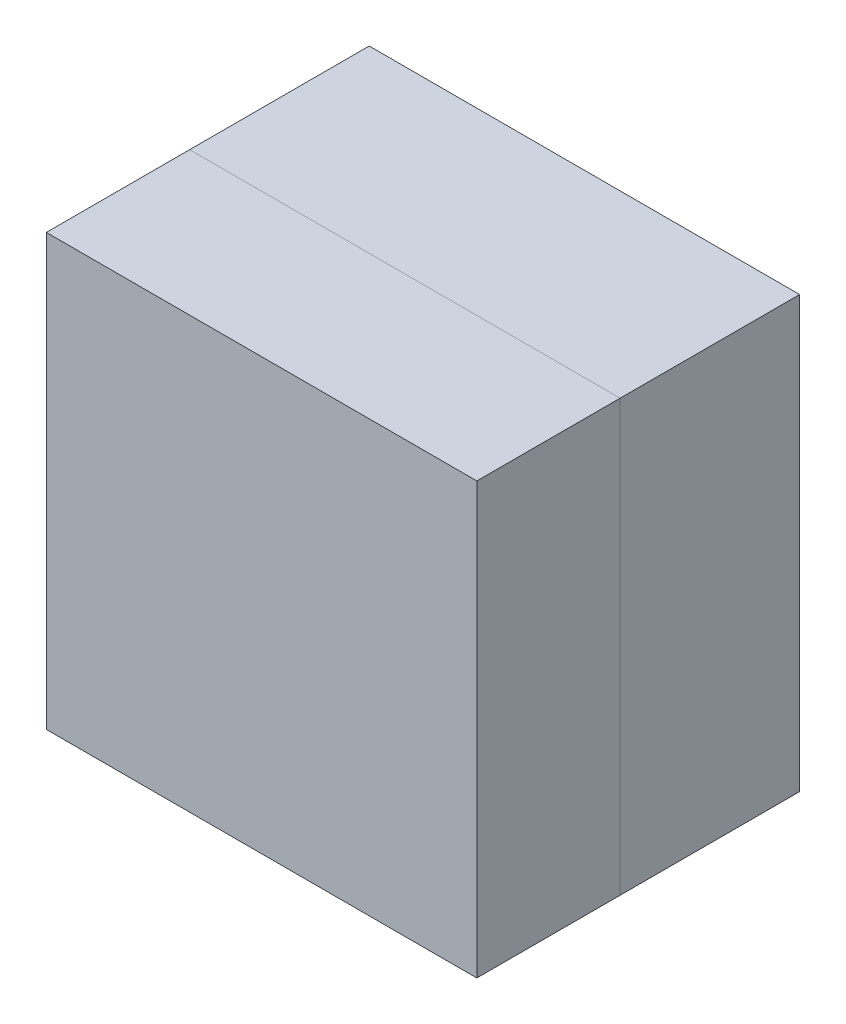
ISO-10303-21;
HEADER;
FILE_DESCRIPTION(('STEP AP214'),'2;1');
FILE_NAME('part.step','',(''),(''),'','','');
FILE_SCHEMA(('AUTOMOTIVE_DESIGN { 1 0 10303 214 1 1 1 1 }'));
ENDSEC;
DATA;
#1=APPLICATION_CONTEXT('core data for automotive mechanical design processes');
#2=APPLICATION_PROTOCOL_DEFINITION('international standard','automotive_design',2000,#1);
#3=PRODUCT_CONTEXT('',#1,'mechanical');
#4=PRODUCT('Part','Part','',(#3));
#5=PRODUCT_RELATED_PRODUCT_CATEGORY('part','',(#4));
#6=PRODUCT_DEFINITION_FORMATION('','',#4);
#7=PRODUCT_DEFINITION_CONTEXT('part definition',#1,'design');
#8=PRODUCT_DEFINITION('design','',#6,#7);
#9=PRODUCT_DEFINITION_SHAPE('','',#8);
#10=(LENGTH_UNIT() NAMED_UNIT(*) SI_UNIT(.MILLI.,.METRE.));
#11=(NAMED_UNIT(*) PLANE_ANGLE_UNIT() SI_UNIT($,.RADIAN.));
#12=(NAMED_UNIT(*) SI_UNIT($,.STERADIAN.) SOLID_ANGLE_UNIT());
#13=UNCERTAINTY_MEASURE_WITH_UNIT(LENGTH_MEASURE(1.E-05),#10,'distance_accuracy_value','');
#14=(GEOMETRIC_REPRESENTATION_CONTEXT(3) GLOBAL_UNCERTAINTY_ASSIGNED_CONTEXT((#13)) GLOBAL_UNIT_ASSIGNED_CONTEXT((#10,
#11,#12)) REPRESENTATION_CONTEXT('',''));
#15=CARTESIAN_POINT('',(0.,0.,0.));
#16=DIRECTION('',(0.,0.,1.));
#17=DIRECTION('',(1.,0.,0.));
#18=AXIS2_PLACEMENT_3D('',#15,#16,#17);
#19=CARTESIAN_POINT('',(0.,-4.61267334725164E-13,127.132943369893));
#20=DIRECTION('',(0.,0.,-1.));
#21=DIRECTION('',(0.,1.,0.));
#22=AXIS2_PLACEMENT_3D('',#19,#20,#21);
#23=PLANE('',#22);
#24=DIRECTION('',(-1.,0.,0.));
#25=VECTOR('',#24,1.);
#26=CARTESIAN_POINT('',(152.4,-152.4,127.132943369892));
#27=LINE('',#26,#25);
#28=CARTESIAN_POINT('',(152.4,-152.4,127.132943369893));
#29=VERTEX_POINT('',#28);
#30=CARTESIAN_POINT('',(-152.4,-152.4,127.132943369892));
#31=VERTEX_POINT('',#30);
#32=EDGE_CURVE('E102',#29,#31,#27,.T.);
#33=ORIENTED_EDGE('',*,*,#32,.T.);
#34=DIRECTION('',(0.,1.,0.));
#35=VECTOR('',#34,1.);
#36=CARTESIAN_POINT('',(-152.4,152.4,127.132943369893));
#37=LINE('',#36,#35);
#38=CARTESIAN_POINT('',(-152.4,152.4,127.132943369893));
#39=VERTEX_POINT('',#38);
#40=EDGE_CURVE('E88',#31,#39,#37,.T.);
#41=ORIENTED_EDGE('',*,*,#40,.T.);
#42=DIRECTION('',(1.,0.,0.));
#43=VECTOR('',#42,1.);
#44=CARTESIAN_POINT('',(152.4,152.4,127.132943369893));
#45=LINE('',#44,#43);
#46=CARTESIAN_POINT('',(152.4,152.4,127.132943369893));
#47=VERTEX_POINT('',#46);
#48=EDGE_CURVE('E100',#39,#47,#45,.T.);
#49=ORIENTED_EDGE('',*,*,#48,.T.);
#50=DIRECTION('',(0.,-1.,0.));
#51=VECTOR('',#50,1.);
#52=CARTESIAN_POINT('',(152.4,152.4,127.132943369893));
#53=LINE('',#52,#51);
#54=EDGE_CURVE('E107',#47,#29,#53,.T.);
#55=ORIENTED_EDGE('',*,*,#54,.T.);
#56=EDGE_LOOP('',(#33,#41,#49,#55));
#57=FACE_BOUND('',#56,.T.);
#58=CARTESIAN_POINT('',(0.90869526163995,-0.0776127525782167,127.132943369893));
#59=DIRECTION('',(0.,0.,1.));
#60=DIRECTION('',(0.,-1.,0.));
#61=AXIS2_PLACEMENT_3D('',#58,#59,#60);
#62=CIRCLE('',#61,91.1860000000005);
#63=CARTESIAN_POINT('',(0.90869526163995,-91.2636127525787,127.132943369892));
#64=VERTEX_POINT('',#63);
#65=EDGE_CURVE('E12',#64,#64,#62,.T.);
#66=ORIENTED_EDGE('',*,*,#65,.T.);
#67=EDGE_LOOP('',(#66));
#68=FACE_BOUND('',#67,.T.);
#69=ADVANCED_FACE('F44',(#57,#68),#23,.T.);
#70=CARTESIAN_POINT('',(0.90869526163995,-138.632902158747,224.450968055005));
#71=DIRECTION('',(0.,0.,-1.));
#72=DIRECTION('',(0.,1.,0.));
#73=AXIS2_PLACEMENT_3D('',#70,#71,#72);
#74=PLANE('',#73);
#75=CARTESIAN_POINT('',(0.90869526163995,-0.0776127525785565,224.450968055006));
#76=DIRECTION('',(0.,0.,1.));
#77=DIRECTION('',(0.,-1.,0.));
#78=AXIS2_PLACEMENT_3D('',#75,#76,#77);
#79=CIRCLE('',#78,138.555289406168);
#80=CARTESIAN_POINT('',(0.90869526163995,-138.632902158747,224.450968055005));
#81=VERTEX_POINT('',#80);
#82=EDGE_CURVE('E143',#81,#81,#79,.T.);
#83=ORIENTED_EDGE('',*,*,#82,.F.);
#84=EDGE_LOOP('',(#83));
#85=FACE_BOUND('',#84,.T.);
#86=ADVANCED_FACE('F157',(#85),#74,.T.);
#87=CARTESIAN_POINT('',(0.90869526163995,-0.0776127525783632,169.085651996013));
#88=DIRECTION('',(0.,0.,1.));
#89=DIRECTION('',(0.,-1.,0.));
#90=AXIS2_PLACEMENT_3D('',#87,#88,#89);
#91=CYLINDRICAL_SURFACE('',#90,138.555289406168);
#92=ORIENTED_EDGE('',*,*,#82,.T.);
#93=EDGE_LOOP('',(#92));
#94=FACE_BOUND('',#93,.T.);
#95=CARTESIAN_POINT('',(0.90869526163995,-0.0776127525785146,212.450968055006));
#96=DIRECTION('',(0.,0.,1.));
#97=DIRECTION('',(0.,-1.,0.));
#98=AXIS2_PLACEMENT_3D('',#95,#96,#97);
#99=CIRCLE('',#98,138.555289406168);
#100=CARTESIAN_POINT('',(0.90869526163995,-138.632902158747,212.450968055005));
#101=VERTEX_POINT('',#100);
#102=EDGE_CURVE('E140',#101,#101,#99,.T.);
#103=ORIENTED_EDGE('',*,*,#102,.F.);
#104=EDGE_LOOP('',(#103));
#105=FACE_BOUND('',#104,.T.);
#106=ADVANCED_FACE('F160',(#94,#105),#91,.F.);
#107=CARTESIAN_POINT('',(0.90869526163995,-0.0776127525785141,212.327662527832));
#108=DIRECTION('',(0.,0.,1.));
#109=DIRECTION('',(0.,-1.,0.));
#110=AXIS2_PLACEMENT_3D('',#107,#108,#109);
#111=TOROIDAL_SURFACE('',#110,134.112,4.44499999999991);
#112=CARTESIAN_POINT('',(0.90869526163995,-0.0776127525784987,207.904943369893));
#113=DIRECTION('',(0.,0.,1.));
#114=DIRECTION('',(0.,-1.,0.));
#115=AXIS2_PLACEMENT_3D('',#112,#113,#114);
#116=CIRCLE('',#115,133.667500000001);
#117=CARTESIAN_POINT('',(0.90869526163995,-133.745112752579,207.904943369892));
#118=VERTEX_POINT('',#117);
#119=EDGE_CURVE('E137',#118,#118,#116,.T.);
#120=ORIENTED_EDGE('',*,*,#119,.F.);
#121=EDGE_LOOP('',(#120));
#122=FACE_BOUND('',#121,.T.);
#123=ORIENTED_EDGE('',*,*,#102,.T.);
#124=EDGE_LOOP('',(#123));
#125=FACE_BOUND('',#124,.T.);
#126=ADVANCED_FACE('F165',(#122,#125),#111,.F.);
#127=CARTESIAN_POINT('',(0.90869526163995,-0.0776127525784766,201.586773144266));
#128=DIRECTION('',(0.,0.,1.));
#129=DIRECTION('',(0.,-1.,0.));
#130=AXIS2_PLACEMENT_3D('',#127,#128,#129);
#131=TOROIDAL_SURFACE('',#130,133.0325,6.34999999999996);
#132=ORIENTED_EDGE('',*,*,#119,.T.);
#133=EDGE_LOOP('',(#132));
#134=FACE_BOUND('',#133,.T.);
#135=CARTESIAN_POINT('',(0.90869526163995,-0.0776127525784766,201.586773144266));
#136=DIRECTION('',(0.,0.,1.));
#137=DIRECTION('',(0.,-1.,0.));
#138=AXIS2_PLACEMENT_3D('',#135,#136,#137);
#139=CIRCLE('',#138,126.6825);
#140=CARTESIAN_POINT('',(0.90869526163995,-126.760112752579,201.586773144265));
#141=VERTEX_POINT('',#140);
#142=EDGE_CURVE('E134',#141,#141,#139,.T.);
#143=ORIENTED_EDGE('',*,*,#142,.F.);
#144=EDGE_LOOP('',(#143));
#145=FACE_BOUND('',#144,.T.);
#146=ADVANCED_FACE('F172',(#134,#145),#131,.T.);
#147=CARTESIAN_POINT('',(0.90869526163995,-0.0776127525783632,169.085651996013));
#148=DIRECTION('',(0.,0.,1.));
#149=DIRECTION('',(0.,-1.,0.));
#150=AXIS2_PLACEMENT_3D('',#147,#148,#149);
#151=CYLINDRICAL_SURFACE('',#150,126.6825);
#152=CARTESIAN_POINT('',(0.90869526163995,-0.0776127525784433,192.029943369893));
#153=DIRECTION('',(0.,0.,1.));
#154=DIRECTION('',(0.,-1.,0.));
#155=AXIS2_PLACEMENT_3D('',#152,#153,#154);
#156=CIRCLE('',#155,126.6825);
#157=CARTESIAN_POINT('',(0.90869526163995,-126.760112752578,192.029943369892));
#158=VERTEX_POINT('',#157);
#159=EDGE_CURVE('E131',#158,#158,#156,.T.);
#160=ORIENTED_EDGE('',*,*,#159,.F.);
#161=EDGE_LOOP('',(#160));
#162=FACE_BOUND('',#161,.T.);
#163=ORIENTED_EDGE('',*,*,#142,.T.);
#164=EDGE_LOOP('',(#163));
#165=FACE_BOUND('',#164,.T.);
#166=ADVANCED_FACE('F176',(#162,#165),#151,.F.);
#167=CARTESIAN_POINT('',(0.90869526163995,-0.0776127525784433,192.029943369893));
#168=DIRECTION('',(0.,0.,1.));
#169=DIRECTION('',(0.,-1.,0.));
#170=AXIS2_PLACEMENT_3D('',#167,#168,#169);
#171=TOROIDAL_SURFACE('',#170,101.2825,25.3999999999999);
#172=CARTESIAN_POINT('',(0.90869526163995,-0.0776127525784355,189.816187504102));
#173=DIRECTION('',(0.,0.,1.));
#174=DIRECTION('',(0.,-1.,0.));
#175=AXIS2_PLACEMENT_3D('',#172,#173,#174);
#176=CIRCLE('',#175,126.58584533153);
#177=CARTESIAN_POINT('',(0.90869526163995,-126.663458084109,189.816187504102));
#178=VERTEX_POINT('',#177);
#179=EDGE_CURVE('E128',#178,#178,#176,.T.);
#180=ORIENTED_EDGE('',*,*,#179,.F.);
#181=EDGE_LOOP('',(#180));
#182=FACE_BOUND('',#181,.T.);
#183=ORIENTED_EDGE('',*,*,#159,.T.);
#184=EDGE_LOOP('',(#183));
#185=FACE_BOUND('',#184,.T.);
#186=ADVANCED_FACE('F180',(#182,#185),#171,.F.);
#187=CARTESIAN_POINT('',(0.90869526163995,-0.0776127525784355,189.816187504102));
#188=DIRECTION('',(0.,0.,1.));
#189=DIRECTION('',(0.,-1.,0.));
#190=AXIS2_PLACEMENT_3D('',#187,#188,#189);
#191=CONICAL_SURFACE('',#190,126.58584533153,0.0872664625997177);
#192=CARTESIAN_POINT('',(0.90869526163995,-0.0776127525783878,176.154943369893));
#193=DIRECTION('',(0.,0.,1.));
#194=DIRECTION('',(0.,-1.,0.));
#195=AXIS2_PLACEMENT_3D('',#192,#193,#194);
#196=CIRCLE('',#195,125.390641340127);
#197=CARTESIAN_POINT('',(0.90869526163995,-125.468254092705,176.154943369892));
#198=VERTEX_POINT('',#197);
#199=EDGE_CURVE('E125',#198,#198,#196,.T.);
#200=ORIENTED_EDGE('',*,*,#199,.F.);
#201=EDGE_LOOP('',(#200));
#202=FACE_BOUND('',#201,.T.);
#203=ORIENTED_EDGE('',*,*,#179,.T.);
#204=EDGE_LOOP('',(#203));
#205=FACE_BOUND('',#204,.T.);
#206=ADVANCED_FACE('F184',(#202,#205),#191,.F.);
#207=CARTESIAN_POINT('',(0.90869526163995,-0.0776127525783936,177.815260269235));
#208=DIRECTION('',(0.,0.,1.));
#209=DIRECTION('',(0.,-1.,0.));
#210=AXIS2_PLACEMENT_3D('',#207,#208,#209);
#211=TOROIDAL_SURFACE('',#210,106.413132341479,19.05);
#212=CARTESIAN_POINT('',(0.90869526163995,-0.0776127525783566,167.222414925144));
#213=DIRECTION('',(0.,0.,1.));
#214=DIRECTION('',(0.,-1.,0.));
#215=AXIS2_PLACEMENT_3D('',#212,#213,#214);
#216=CIRCLE('',#215,122.246455666548);
#217=CARTESIAN_POINT('',(0.90869526163995,-122.324068419126,167.222414925144));
#218=VERTEX_POINT('',#217);
#219=EDGE_CURVE('E122',#218,#218,#216,.T.);
#220=ORIENTED_EDGE('',*,*,#219,.F.);
#221=EDGE_LOOP('',(#220));
#222=FACE_BOUND('',#221,.T.);
#223=ORIENTED_EDGE('',*,*,#199,.T.);
#224=EDGE_LOOP('',(#223));
#225=FACE_BOUND('',#224,.T.);
#226=ADVANCED_FACE('F188',(#222,#225),#211,.F.);
#227=CARTESIAN_POINT('',(0.90869526163995,-0.0776127525783566,167.222414925144));
#228=DIRECTION('',(0.,0.,1.));
#229=DIRECTION('',(0.,-1.,0.));
#230=AXIS2_PLACEMENT_3D('',#227,#228,#229);
#231=CONICAL_SURFACE('',#230,122.246455666548,0.58963160852596);
#232=CARTESIAN_POINT('',(0.90869526163995,-0.077612752578229,130.656757809854));
#233=DIRECTION('',(0.,0.,1.));
#234=DIRECTION('',(0.,-1.,0.));
#235=AXIS2_PLACEMENT_3D('',#232,#233,#234);
#236=CIRCLE('',#235,97.7832180521123);
#237=CARTESIAN_POINT('',(0.90869526163995,-97.8608308046906,130.656757809854));
#238=VERTEX_POINT('',#237);
#239=EDGE_CURVE('E53',#238,#238,#236,.T.);
#240=ORIENTED_EDGE('',*,*,#239,.F.);
#241=EDGE_LOOP('',(#240));
#242=FACE_BOUND('',#241,.T.);
#243=ORIENTED_EDGE('',*,*,#219,.T.);
#244=EDGE_LOOP('',(#243));
#245=FACE_BOUND('',#244,.T.);
#246=ADVANCED_FACE('F192',(#242,#245),#231,.F.);
#247=CARTESIAN_POINT('',(0.90869526163995,-0.0776127525782444,135.070443369893));
#248=DIRECTION('',(0.,0.,1.));
#249=DIRECTION('',(0.,-1.,0.));
#250=AXIS2_PLACEMENT_3D('',#247,#248,#249);
#251=TOROIDAL_SURFACE('',#250,91.1860000000004,7.93750000000004);
#252=ORIENTED_EDGE('',*,*,#65,.F.);
#253=EDGE_LOOP('',(#252));
#254=FACE_BOUND('',#253,.T.);
#255=ORIENTED_EDGE('',*,*,#239,.T.);
#256=EDGE_LOOP('',(#255));
#257=FACE_BOUND('',#256,.T.);
#258=ADVANCED_FACE('F196',(#254,#257),#251,.F.);
#259=CARTESIAN_POINT('',(-152.4,152.4,228.6));
#260=DIRECTION('',(1.,0.,0.));
#261=DIRECTION('',(0.,1.,0.));
#262=AXIS2_PLACEMENT_3D('',#259,#260,#261);
#263=PLANE('',#262);
#264=ORIENTED_EDGE('',*,*,#40,.F.);
#265=DIRECTION('',(0.,0.,-1.));
#266=VECTOR('',#265,1.);
#267=CARTESIAN_POINT('',(-152.4,-152.4,228.6));
#268=LINE('',#267,#266);
#269=CARTESIAN_POINT('',(-152.4,-152.4,228.6));
#270=VERTEX_POINT('',#269);
#271=EDGE_CURVE('E103',#270,#31,#268,.T.);
#272=ORIENTED_EDGE('',*,*,#271,.F.);
#273=DIRECTION('',(0.,-1.,0.));
#274=VECTOR('',#273,1.);
#275=CARTESIAN_POINT('',(-152.4,152.4,228.6));
#276=LINE('',#275,#274);
#277=CARTESIAN_POINT('',(-152.4,152.4,228.6));
#278=VERTEX_POINT('',#277);
#279=EDGE_CURVE('E90',#278,#270,#276,.T.);
#280=ORIENTED_EDGE('',*,*,#279,.F.);
#281=DIRECTION('',(0.,0.,-1.));
#282=VECTOR('',#281,1.);
#283=CARTESIAN_POINT('',(-152.4,152.4,228.6));
#284=LINE('',#283,#282);
#285=EDGE_CURVE('E48',#278,#39,#284,.T.);
#286=ORIENTED_EDGE('',*,*,#285,.T.);
#287=EDGE_LOOP('',(#264,#272,#280,#286));
#288=FACE_BOUND('',#287,.T.);
#289=ADVANCED_FACE('F86',(#288),#263,.F.);
#290=CARTESIAN_POINT('',(152.4,-152.4,228.6));
#291=DIRECTION('',(0.,1.,0.));
#292=DIRECTION('',(-1.,0.,0.));
#293=AXIS2_PLACEMENT_3D('',#290,#291,#292);
#294=PLANE('',#293);
#295=ORIENTED_EDGE('',*,*,#32,.F.);
#296=DIRECTION('',(0.,0.,-1.));
#297=VECTOR('',#296,1.);
#298=CARTESIAN_POINT('',(152.4,-152.4,228.6));
#299=LINE('',#298,#297);
#300=CARTESIAN_POINT('',(152.4,-152.4,228.6));
#301=VERTEX_POINT('',#300);
#302=EDGE_CURVE('E113',#301,#29,#299,.T.);
#303=ORIENTED_EDGE('',*,*,#302,.F.);
#304=DIRECTION('',(1.,0.,0.));
#305=VECTOR('',#304,1.);
#306=CARTESIAN_POINT('',(152.4,-152.4,228.6));
#307=LINE('',#306,#305);
#308=EDGE_CURVE('E61',#270,#301,#307,.T.);
#309=ORIENTED_EDGE('',*,*,#308,.F.);
#310=ORIENTED_EDGE('',*,*,#271,.T.);
#311=EDGE_LOOP('',(#295,#303,#309,#310));
#312=FACE_BOUND('',#311,.T.);
#313=ADVANCED_FACE('F118',(#312),#294,.F.);
#314=CARTESIAN_POINT('',(152.4,152.4,228.6));
#315=DIRECTION('',(-1.,0.,0.));
#316=DIRECTION('',(0.,-1.,0.));
#317=AXIS2_PLACEMENT_3D('',#314,#315,#316);
#318=PLANE('',#317);
#319=ORIENTED_EDGE('',*,*,#54,.F.);
#320=DIRECTION('',(0.,0.,-1.));
#321=VECTOR('',#320,1.);
#322=CARTESIAN_POINT('',(152.4,152.4,228.6));
#323=LINE('',#322,#321);
#324=CARTESIAN_POINT('',(152.4,152.4,228.6));
#325=VERTEX_POINT('',#324);
#326=EDGE_CURVE('E95',#325,#47,#323,.T.);
#327=ORIENTED_EDGE('',*,*,#326,.F.);
#328=DIRECTION('',(0.,1.,0.));
#329=VECTOR('',#328,1.);
#330=CARTESIAN_POINT('',(152.4,152.4,228.6));
#331=LINE('',#330,#329);
#332=EDGE_CURVE('E117',#301,#325,#331,.T.);
#333=ORIENTED_EDGE('',*,*,#332,.F.);
#334=ORIENTED_EDGE('',*,*,#302,.T.);
#335=EDGE_LOOP('',(#319,#327,#333,#334));
#336=FACE_BOUND('',#335,.T.);
#337=ADVANCED_FACE('F116',(#336),#318,.F.);
#338=CARTESIAN_POINT('',(152.4,152.4,228.6));
#339=DIRECTION('',(0.,-1.,0.));
#340=DIRECTION('',(1.,0.,0.));
#341=AXIS2_PLACEMENT_3D('',#338,#339,#340);
#342=PLANE('',#341);
#343=ORIENTED_EDGE('',*,*,#48,.F.);
#344=ORIENTED_EDGE('',*,*,#285,.F.);
#345=DIRECTION('',(-1.,0.,0.));
#346=VECTOR('',#345,1.);
#347=CARTESIAN_POINT('',(152.4,152.4,228.6));
#348=LINE('',#347,#346);
#349=EDGE_CURVE('E94',#325,#278,#348,.T.);
#350=ORIENTED_EDGE('',*,*,#349,.F.);
#351=ORIENTED_EDGE('',*,*,#326,.T.);
#352=EDGE_LOOP('',(#343,#344,#350,#351));
#353=FACE_BOUND('',#352,.T.);
#354=ADVANCED_FACE('F46',(#353),#342,.F.);
#355=CARTESIAN_POINT('',(0.,0.,228.6));
#356=DIRECTION('',(0.,0.,-1.));
#357=DIRECTION('',(-1.,0.,0.));
#358=AXIS2_PLACEMENT_3D('',#355,#356,#357);
#359=PLANE('',#358);
#360=ORIENTED_EDGE('',*,*,#279,.T.);
#361=ORIENTED_EDGE('',*,*,#308,.T.);
#362=ORIENTED_EDGE('',*,*,#332,.T.);
#363=ORIENTED_EDGE('',*,*,#349,.T.);
#364=EDGE_LOOP('',(#360,#361,#362,#363));
#365=FACE_BOUND('',#364,.T.);
#366=ADVANCED_FACE('F149',(#365),#359,.F.);
#367=CLOSED_SHELL('',(#69,#86,#106,#126,#146,#166,#186,#206,#226,#246,#258,#289,#313,#337,#354,#366));
#368=MANIFOLD_SOLID_BREP('B2',#367);
#369=CARTESIAN_POINT('',(0.,-4.61267334725164E-13,127.132943369893));
#370=DIRECTION('',(0.,0.,-1.));
#371=DIRECTION('',(0.,1.,0.));
#372=AXIS2_PLACEMENT_3D('',#369,#370,#371);
#373=PLANE('',#372);
#374=CARTESIAN_POINT('',(0.90869526163995,-0.0776127525782167,127.132943369893));
#375=DIRECTION('',(0.,0.,1.));
#376=DIRECTION('',(0.,-1.,0.));
#377=AXIS2_PLACEMENT_3D('',#374,#375,#376);
#378=CIRCLE('',#377,91.7987750000028);
#379=CARTESIAN_POINT('',(0.90869526163995,-91.876387752581,127.132943369892));
#380=VERTEX_POINT('',#379);
#381=EDGE_CURVE('E382',#380,#380,#378,.T.);
#382=ORIENTED_EDGE('',*,*,#381,.F.);
#383=EDGE_LOOP('',(#382));
#384=FACE_BOUND('',#383,.T.);
#385=DIRECTION('',(-1.,0.,0.));
#386=VECTOR('',#385,1.);
#387=CARTESIAN_POINT('',(152.4,-152.4,127.132943369892));
#388=LINE('',#387,#386);
#389=CARTESIAN_POINT('',(152.4,-152.4,127.132943369893));
#390=VERTEX_POINT('',#389);
#391=CARTESIAN_POINT('',(-152.4,-152.4,127.132943369892));
#392=VERTEX_POINT('',#391);
#393=EDGE_CURVE('E327',#390,#392,#388,.T.);
#394=ORIENTED_EDGE('',*,*,#393,.F.);
#395=DIRECTION('',(0.,-1.,0.));
#396=VECTOR('',#395,1.);
#397=CARTESIAN_POINT('',(152.4,152.4,127.132943369893));
#398=LINE('',#397,#396);
#399=CARTESIAN_POINT('',(152.4,152.4,127.132943369893));
#400=VERTEX_POINT('',#399);
#401=EDGE_CURVE('E340',#400,#390,#398,.T.);
#402=ORIENTED_EDGE('',*,*,#401,.F.);
#403=DIRECTION('',(1.,0.,0.));
#404=VECTOR('',#403,1.);
#405=CARTESIAN_POINT('',(152.4,152.4,127.132943369893));
#406=LINE('',#405,#404);
#407=CARTESIAN_POINT('',(-152.4,152.4,127.132943369893));
#408=VERTEX_POINT('',#407);
#409=EDGE_CURVE('E367',#408,#400,#406,.T.);
#410=ORIENTED_EDGE('',*,*,#409,.F.);
#411=DIRECTION('',(0.,1.,0.));
#412=VECTOR('',#411,1.);
#413=CARTESIAN_POINT('',(-152.4,152.4,127.132943369893));
#414=LINE('',#413,#412);
#415=EDGE_CURVE('E42',#392,#408,#414,.T.);
#416=ORIENTED_EDGE('',*,*,#415,.F.);
#417=EDGE_LOOP('',(#394,#402,#410,#416));
#418=FACE_BOUND('',#417,.T.);
#419=ADVANCED_FACE('F320',(#384,#418),#373,.F.);
#420=CARTESIAN_POINT('',(0.90869526163995,-91.876387752581,127.132943369892));
#421=CARTESIAN_POINT('',(0.90869526163995,-94.6834634015012,127.132943369892));
#422=CARTESIAN_POINT('',(0.90869526163995,-97.40004583746,126.518818236651));
#423=CARTESIAN_POINT('',(0.90869526163995,-99.903113005087,125.348106712939));
#424=(BOUNDED_CURVE() B_SPLINE_CURVE(3,(#420,#421,#422,#423),.UNSPECIFIED.,.F.,
.F.) B_SPLINE_CURVE_WITH_KNOTS((4,4),(0.,1.),
.UNSPECIFIED.) CURVE() GEOMETRIC_REPRESENTATION_ITEM() RATIONAL_B_SPLINE_CURVE((0.254333095030252,
0.254333095030252,0.258499793724843,0.266833191114025)) REPRESENTATION_ITEM(''));
#425=CARTESIAN_POINT('',(0.90869526163995,-0.0776127525783632,169.085651996013));
#426=DIRECTION('',(0.,0.,1.));
#427=AXIS1_PLACEMENT('',#425,#426);
#428=SURFACE_OF_REVOLUTION('',#424,#427);
#429=CARTESIAN_POINT('',(0.90869526163995,-0.0776127525782104,125.348106712939));
#430=DIRECTION('',(0.,0.,1.));
#431=DIRECTION('',(0.,-1.,0.));
#432=AXIS2_PLACEMENT_3D('',#429,#430,#431);
#433=CIRCLE('',#432,99.8255002525088);
#434=CARTESIAN_POINT('',(0.90869526163995,-99.903113005087,125.348106712939));
#435=VERTEX_POINT('',#434);
#436=EDGE_CURVE('E385',#435,#435,#433,.T.);
#437=ORIENTED_EDGE('',*,*,#436,.F.);
#438=EDGE_LOOP('',(#437));
#439=FACE_BOUND('',#438,.T.);
#440=ORIENTED_EDGE('',*,*,#381,.T.);
#441=EDGE_LOOP('',(#440));
#442=FACE_BOUND('',#441,.T.);
#443=ADVANCED_FACE('F410',(#439,#442),#428,.T.);
#444=CARTESIAN_POINT('',(0.90869526163995,-0.077612752578179,116.353347557886));
#445=DIRECTION('',(0.,0.,-1.));
#446=DIRECTION('',(0.,1.,0.));
#447=AXIS2_PLACEMENT_3D('',#444,#445,#446);
#448=CONICAL_SURFACE('',#447,119.056955539065,1.13331210913777);
#449=ORIENTED_EDGE('',*,*,#436,.T.);
#450=EDGE_LOOP('',(#449));
#451=FACE_BOUND('',#450,.T.);
#452=CARTESIAN_POINT('',(0.90869526163995,-0.077612752578179,116.353347557886));
#453=DIRECTION('',(0.,0.,1.));
#454=DIRECTION('',(0.,-1.,0.));
#455=AXIS2_PLACEMENT_3D('',#452,#453,#454);
#456=CIRCLE('',#455,119.056955539065);
#457=CARTESIAN_POINT('',(0.90869526163995,-119.134568291643,116.353347557886));
#458=VERTEX_POINT('',#457);
#459=EDGE_CURVE('E458',#458,#458,#456,.T.);
#460=ORIENTED_EDGE('',*,*,#459,.F.);
#461=EDGE_LOOP('',(#460));
#462=FACE_BOUND('',#461,.T.);
#463=ADVANCED_FACE('F415',(#451,#462),#448,.F.);
#464=CARTESIAN_POINT('',(0.90869526163995,-0.0776127525781537,109.10678459855));
#465=DIRECTION('',(0.,0.,1.));
#466=DIRECTION('',(0.,-1.,0.));
#467=AXIS2_PLACEMENT_3D('',#464,#465,#466);
#468=TOROIDAL_SURFACE('',#467,115.667659848753,8.);
#469=ORIENTED_EDGE('',*,*,#459,.T.);
#470=EDGE_LOOP('',(#469));
#471=FACE_BOUND('',#470,.T.);
#472=CARTESIAN_POINT('',(0.90869526163995,-0.0776127525781548,109.41388707125));
#473=DIRECTION('',(0.,0.,1.));
#474=DIRECTION('',(0.,-1.,0.));
#475=AXIS2_PLACEMENT_3D('',#472,#473,#474);
#476=CIRCLE('',#475,123.661763180038);
#477=CARTESIAN_POINT('',(0.90869526163995,-123.739375932616,109.413887071249));
#478=VERTEX_POINT('',#477);
#479=EDGE_CURVE('E455',#478,#478,#476,.T.);
#480=ORIENTED_EDGE('',*,*,#479,.F.);
#481=EDGE_LOOP('',(#480));
#482=FACE_BOUND('',#481,.T.);
#483=ADVANCED_FACE('F466',(#471,#482),#468,.F.);
#484=CARTESIAN_POINT('',(0.90869526163995,-0.0776127525779172,41.3463400319306));
#485=DIRECTION('',(0.,0.,-1.));
#486=DIRECTION('',(0.,1.,0.));
#487=AXIS2_PLACEMENT_3D('',#484,#485,#486);
#488=CONICAL_SURFACE('',#487,126.276654574374,0.0383972435438753);
#489=ORIENTED_EDGE('',*,*,#479,.T.);
#490=EDGE_LOOP('',(#489));
#491=FACE_BOUND('',#490,.T.);
#492=CARTESIAN_POINT('',(0.90869526163995,-0.0776127525779172,41.3463400319306));
#493=DIRECTION('',(0.,0.,1.));
#494=DIRECTION('',(0.,-1.,0.));
#495=AXIS2_PLACEMENT_3D('',#492,#493,#494);
#496=CIRCLE('',#495,126.276654574374);
#497=CARTESIAN_POINT('',(0.90869526163995,-126.354267326952,41.3463400319301));
#498=VERTEX_POINT('',#497);
#499=EDGE_CURVE('E452',#498,#498,#496,.T.);
#500=ORIENTED_EDGE('',*,*,#499,.F.);
#501=EDGE_LOOP('',(#500));
#502=FACE_BOUND('',#501,.T.);
#503=ADVANCED_FACE('F471',(#491,#502),#488,.F.);
#504=CARTESIAN_POINT('',(0.90869526163995,-0.0776127525779125,40.0027667138672));
#505=DIRECTION('',(0.,0.,1.));
#506=DIRECTION('',(0.,-1.,0.));
#507=AXIS2_PLACEMENT_3D('',#504,#505,#506);
#508=TOROIDAL_SURFACE('',#507,91.302452500002,35.);
#509=ORIENTED_EDGE('',*,*,#499,.T.);
#510=EDGE_LOOP('',(#509));
#511=FACE_BOUND('',#510,.T.);
#512=CARTESIAN_POINT('',(0.90869526163995,-0.0776127525779125,40.0027667138671));
#513=DIRECTION('',(0.,0.,1.));
#514=DIRECTION('',(0.,-1.,0.));
#515=AXIS2_PLACEMENT_3D('',#512,#513,#514);
#516=CIRCLE('',#515,126.302452500002);
#517=CARTESIAN_POINT('',(0.90869526163995,-126.38006525258,40.0027667138667));
#518=VERTEX_POINT('',#517);
#519=EDGE_CURVE('E449',#518,#518,#516,.T.);
#520=ORIENTED_EDGE('',*,*,#519,.F.);
#521=EDGE_LOOP('',(#520));
#522=FACE_BOUND('',#521,.T.);
#523=ADVANCED_FACE('F476',(#511,#522),#508,.F.);
#524=CARTESIAN_POINT('',(0.90869526163995,-0.0776127525783632,169.085651996013));
#525=DIRECTION('',(0.,0.,1.));
#526=DIRECTION('',(0.,-1.,0.));
#527=AXIS2_PLACEMENT_3D('',#524,#525,#526);
#528=CYLINDRICAL_SURFACE('',#527,126.302452500002);
#529=CARTESIAN_POINT('',(0.90869526163995,-0.0776127525778679,27.2484054174911));
#530=DIRECTION('',(0.,0.,1.));
#531=DIRECTION('',(0.,-1.,0.));
#532=AXIS2_PLACEMENT_3D('',#529,#530,#531);
#533=CIRCLE('',#532,126.302452500002);
#534=CARTESIAN_POINT('',(0.90869526163995,-126.38006525258,27.2484054174907));
#535=VERTEX_POINT('',#534);
#536=EDGE_CURVE('E446',#535,#535,#533,.T.);
#537=ORIENTED_EDGE('',*,*,#536,.F.);
#538=EDGE_LOOP('',(#537));
#539=FACE_BOUND('',#538,.T.);
#540=ORIENTED_EDGE('',*,*,#519,.T.);
#541=EDGE_LOOP('',(#540));
#542=FACE_BOUND('',#541,.T.);
#543=ADVANCED_FACE('F482',(#539,#542),#528,.F.);
#544=CARTESIAN_POINT('',(0.90869526163995,-133.59734825258,20.9609433698914));
#545=CARTESIAN_POINT('',(0.90869526163995,-128.912310640584,20.2965209052261));
#546=CARTESIAN_POINT('',(0.90869526163995,-126.38006525258,23.7261671924004));
#547=CARTESIAN_POINT('',(0.90869526163995,-126.38006525258,27.2484054174907));
#548=(BOUNDED_CURVE() B_SPLINE_CURVE(3,(#544,#545,#546,#547),.UNSPECIFIED.,.F.,
.F.) B_SPLINE_CURVE_WITH_KNOTS((4,4),(0.,1.),
.UNSPECIFIED.) CURVE() GEOMETRIC_REPRESENTATION_ITEM() RATIONAL_B_SPLINE_CURVE((0.255591691964593,
0.242825015050018,0.327183181081988,0.508666190060503)) REPRESENTATION_ITEM(''));
#549=CARTESIAN_POINT('',(0.90869526163995,-0.0776127525783632,169.085651996013));
#550=DIRECTION('',(0.,0.,1.));
#551=AXIS1_PLACEMENT('',#549,#550);
#552=SURFACE_OF_REVOLUTION('',#548,#551);
#553=ORIENTED_EDGE('',*,*,#536,.T.);
#554=EDGE_LOOP('',(#553));
#555=FACE_BOUND('',#554,.T.);
#556=CARTESIAN_POINT('',(0.90869526163995,-0.077612752577846,20.9609433698918));
#557=DIRECTION('',(0.,0.,1.));
#558=DIRECTION('',(0.,-1.,0.));
#559=AXIS2_PLACEMENT_3D('',#556,#557,#558);
#560=CIRCLE('',#559,133.519735500002);
#561=CARTESIAN_POINT('',(0.90869526163995,-133.59734825258,20.9609433698914));
#562=VERTEX_POINT('',#561);
#563=EDGE_CURVE('E443',#562,#562,#560,.T.);
#564=ORIENTED_EDGE('',*,*,#563,.F.);
#565=EDGE_LOOP('',(#564));
#566=FACE_BOUND('',#565,.T.);
#567=ADVANCED_FACE('F487',(#555,#566),#552,.F.);
#568=CARTESIAN_POINT('',(0.90869526163995,-133.59734825258,20.9609433698914));
#569=CARTESIAN_POINT('',(0.90869526163995,-136.783173828737,21.4127506458637));
#570=CARTESIAN_POINT('',(0.90869526163995,-138.50510069258,19.0805911705852));
#571=CARTESIAN_POINT('',(0.90869526163995,-138.50510069258,16.685469177524));
#572=(BOUNDED_CURVE() B_SPLINE_CURVE(3,(#568,#569,#570,#571),.UNSPECIFIED.,.F.,
.F.) B_SPLINE_CURVE_WITH_KNOTS((4,4),(0.,1.),
.UNSPECIFIED.) CURVE() GEOMETRIC_REPRESENTATION_ITEM() RATIONAL_B_SPLINE_CURVE((0.255591691964592,
0.242825015050017,0.327183181081988,0.508666190060503)) REPRESENTATION_ITEM(''));
#573=CARTESIAN_POINT('',(0.90869526163995,-0.0776127525783632,169.085651996013));
#574=DIRECTION('',(0.,0.,1.));
#575=AXIS1_PLACEMENT('',#573,#574);
#576=SURFACE_OF_REVOLUTION('',#572,#575);
#577=CARTESIAN_POINT('',(0.90869526163995,-0.0776127525778311,16.6854691775245));
#578=DIRECTION('',(0.,0.,1.));
#579=DIRECTION('',(0.,-1.,0.));
#580=AXIS2_PLACEMENT_3D('',#577,#578,#579);
#581=CIRCLE('',#580,138.427487940002);
#582=CARTESIAN_POINT('',(0.90869526163995,-138.50510069258,16.685469177524));
#583=VERTEX_POINT('',#582);
#584=EDGE_CURVE('E440',#583,#583,#581,.T.);
#585=ORIENTED_EDGE('',*,*,#584,.F.);
#586=EDGE_LOOP('',(#585));
#587=FACE_BOUND('',#586,.T.);
#588=ORIENTED_EDGE('',*,*,#563,.T.);
#589=EDGE_LOOP('',(#588));
#590=FACE_BOUND('',#589,.T.);
#591=ADVANCED_FACE('F493',(#587,#590),#576,.T.);
#592=CARTESIAN_POINT('',(0.90869526163995,-0.0776127525783632,169.085651996013));
#593=DIRECTION('',(0.,0.,1.));
#594=DIRECTION('',(0.,-1.,0.));
#595=AXIS2_PLACEMENT_3D('',#592,#593,#594);
#596=CYLINDRICAL_SURFACE('',#595,138.427487940002);
#597=CARTESIAN_POINT('',(0.90869526163995,-0.0776127525777892,4.68546917752451));
#598=DIRECTION('',(0.,0.,1.));
#599=DIRECTION('',(0.,-1.,0.));
#600=AXIS2_PLACEMENT_3D('',#597,#598,#599);
#601=CIRCLE('',#600,138.427487940002);
#602=CARTESIAN_POINT('',(0.90869526163995,-138.50510069258,4.68546917752402));
#603=VERTEX_POINT('',#602);
#604=EDGE_CURVE('E434',#603,#603,#601,.T.);
#605=ORIENTED_EDGE('',*,*,#604,.F.);
#606=EDGE_LOOP('',(#605));
#607=FACE_BOUND('',#606,.T.);
#608=ORIENTED_EDGE('',*,*,#584,.T.);
#609=EDGE_LOOP('',(#608));
#610=FACE_BOUND('',#609,.T.);
#611=ADVANCED_FACE('F500',(#607,#610),#596,.F.);
#612=CARTESIAN_POINT('',(0.90869526163995,-138.50510069258,4.68546917752402));
#613=DIRECTION('',(0.,0.,-1.));
#614=DIRECTION('',(0.,1.,0.));
#615=AXIS2_PLACEMENT_3D('',#612,#613,#614);
#616=PLANE('',#615);
#617=ORIENTED_EDGE('',*,*,#604,.T.);
#618=EDGE_LOOP('',(#617));
#619=FACE_BOUND('',#618,.T.);
#620=ADVANCED_FACE('F510',(#619),#616,.F.);
#621=CARTESIAN_POINT('',(152.4,-152.4,228.6));
#622=DIRECTION('',(0.,1.,0.));
#623=DIRECTION('',(-1.,0.,0.));
#624=AXIS2_PLACEMENT_3D('',#621,#622,#623);
#625=PLANE('',#624);
#626=DIRECTION('',(0.,0.,-1.));
#627=VECTOR('',#626,1.);
#628=CARTESIAN_POINT('',(152.4,-152.4,228.6));
#629=LINE('',#628,#627);
#630=CARTESIAN_POINT('',(152.4,-152.4,0.));
#631=VERTEX_POINT('',#630);
#632=EDGE_CURVE('E368',#390,#631,#629,.T.);
#633=ORIENTED_EDGE('',*,*,#632,.F.);
#634=ORIENTED_EDGE('',*,*,#393,.T.);
#635=DIRECTION('',(0.,0.,-1.));
#636=VECTOR('',#635,1.);
#637=CARTESIAN_POINT('',(-152.4,-152.4,228.6));
#638=LINE('',#637,#636);
#639=CARTESIAN_POINT('',(-152.4,-152.4,0.));
#640=VERTEX_POINT('',#639);
#641=EDGE_CURVE('E359',#392,#640,#638,.T.);
#642=ORIENTED_EDGE('',*,*,#641,.T.);
#643=DIRECTION('',(1.,0.,0.));
#644=VECTOR('',#643,1.);
#645=CARTESIAN_POINT('',(152.4,-152.4,0.));
#646=LINE('',#645,#644);
#647=EDGE_CURVE('E363',#640,#631,#646,.T.);
#648=ORIENTED_EDGE('',*,*,#647,.T.);
#649=EDGE_LOOP('',(#633,#634,#642,#648));
#650=FACE_BOUND('',#649,.T.);
#651=ADVANCED_FACE('F362',(#650),#625,.F.);
#652=CARTESIAN_POINT('',(0.,0.,0.));
#653=DIRECTION('',(0.,0.,-1.));
#654=DIRECTION('',(-1.,0.,0.));
#655=AXIS2_PLACEMENT_3D('',#652,#653,#654);
#656=PLANE('',#655);
#657=DIRECTION('',(0.,-1.,0.));
#658=VECTOR('',#657,1.);
#659=CARTESIAN_POINT('',(-152.4,152.4,0.));
#660=LINE('',#659,#658);
#661=CARTESIAN_POINT('',(-152.4,152.4,0.));
#662=VERTEX_POINT('',#661);
#663=EDGE_CURVE('E374',#662,#640,#660,.T.);
#664=ORIENTED_EDGE('',*,*,#663,.F.);
#665=DIRECTION('',(-1.,0.,0.));
#666=VECTOR('',#665,1.);
#667=CARTESIAN_POINT('',(152.4,152.4,0.));
#668=LINE('',#667,#666);
#669=CARTESIAN_POINT('',(152.4,152.4,0.));
#670=VERTEX_POINT('',#669);
#671=EDGE_CURVE('E390',#670,#662,#668,.T.);
#672=ORIENTED_EDGE('',*,*,#671,.F.);
#673=DIRECTION('',(0.,1.,0.));
#674=VECTOR('',#673,1.);
#675=CARTESIAN_POINT('',(152.4,152.4,0.));
#676=LINE('',#675,#674);
#677=EDGE_CURVE('E376',#631,#670,#676,.T.);
#678=ORIENTED_EDGE('',*,*,#677,.F.);
#679=ORIENTED_EDGE('',*,*,#647,.F.);
#680=EDGE_LOOP('',(#664,#672,#678,#679));
#681=FACE_BOUND('',#680,.T.);
#682=ADVANCED_FACE('F372',(#681),#656,.T.);
#683=CARTESIAN_POINT('',(152.4,152.4,228.6));
#684=DIRECTION('',(-1.,0.,0.));
#685=DIRECTION('',(0.,-1.,0.));
#686=AXIS2_PLACEMENT_3D('',#683,#684,#685);
#687=PLANE('',#686);
#688=DIRECTION('',(0.,0.,-1.));
#689=VECTOR('',#688,1.);
#690=CARTESIAN_POINT('',(152.4,152.4,228.6));
#691=LINE('',#690,#689);
#692=EDGE_CURVE('E393',#400,#670,#691,.T.);
#693=ORIENTED_EDGE('',*,*,#692,.F.);
#694=ORIENTED_EDGE('',*,*,#401,.T.);
#695=ORIENTED_EDGE('',*,*,#632,.T.);
#696=ORIENTED_EDGE('',*,*,#677,.T.);
#697=EDGE_LOOP('',(#693,#694,#695,#696));
#698=FACE_BOUND('',#697,.T.);
#699=ADVANCED_FACE('F399',(#698),#687,.F.);
#700=CARTESIAN_POINT('',(-152.4,152.4,228.6));
#701=DIRECTION('',(1.,0.,0.));
#702=DIRECTION('',(0.,1.,0.));
#703=AXIS2_PLACEMENT_3D('',#700,#701,#702);
#704=PLANE('',#703);
#705=ORIENTED_EDGE('',*,*,#641,.F.);
#706=ORIENTED_EDGE('',*,*,#415,.T.);
#707=DIRECTION('',(0.,0.,-1.));
#708=VECTOR('',#707,1.);
#709=CARTESIAN_POINT('',(-152.4,152.4,228.6));
#710=LINE('',#709,#708);
#711=EDGE_CURVE('E380',#408,#662,#710,.T.);
#712=ORIENTED_EDGE('',*,*,#711,.T.);
#713=ORIENTED_EDGE('',*,*,#663,.T.);
#714=EDGE_LOOP('',(#705,#706,#712,#713));
#715=FACE_BOUND('',#714,.T.);
#716=ADVANCED_FACE('F378',(#715),#704,.F.);
#717=CARTESIAN_POINT('',(152.4,152.4,228.6));
#718=DIRECTION('',(0.,-1.,0.));
#719=DIRECTION('',(1.,0.,0.));
#720=AXIS2_PLACEMENT_3D('',#717,#718,#719);
#721=PLANE('',#720);
#722=ORIENTED_EDGE('',*,*,#711,.F.);
#723=ORIENTED_EDGE('',*,*,#409,.T.);
#724=ORIENTED_EDGE('',*,*,#692,.T.);
#725=ORIENTED_EDGE('',*,*,#671,.T.);
#726=EDGE_LOOP('',(#722,#723,#724,#725));
#727=FACE_BOUND('',#726,.T.);
#728=ADVANCED_FACE('F398',(#727),#721,.F.);
#729=CLOSED_SHELL('',(#419,#443,#463,#483,#503,#523,#543,#567,#591,#611,#620,#651,#682,#699,
#716,#728));
#730=MANIFOLD_SOLID_BREP('B6',#729);
#731=ADVANCED_BREP_SHAPE_REPRESENTATION('',(#18,#368,#730),#14);
#732=SHAPE_DEFINITION_REPRESENTATION(#9,#731);
ENDSEC;
END-ISO-10303-21;
